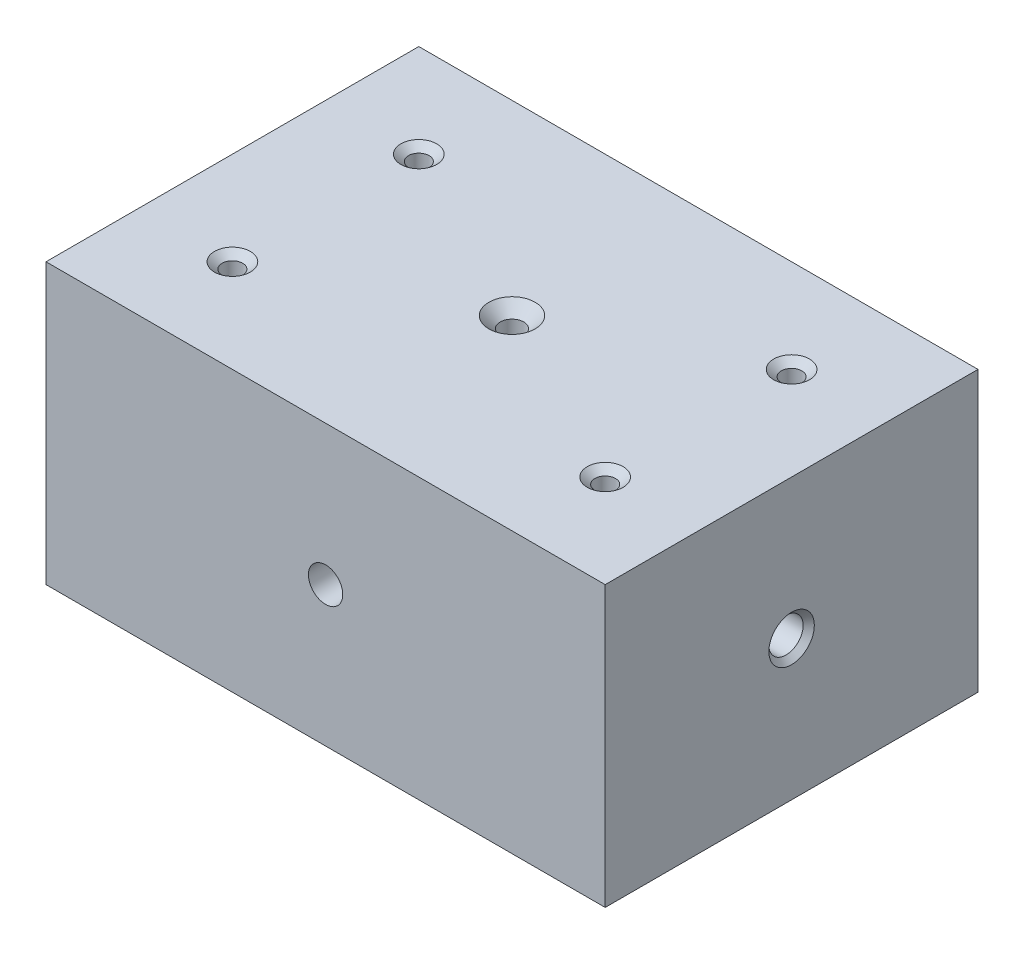
ISO-10303-21;
HEADER;
FILE_DESCRIPTION(('STEP AP214'),'2;1');
FILE_NAME('part.step','',(''),(''),'','','');
FILE_SCHEMA(('AUTOMOTIVE_DESIGN { 1 0 10303 214 1 1 1 1 }'));
ENDSEC;
DATA;
#1=APPLICATION_CONTEXT('core data for automotive mechanical design processes');
#2=APPLICATION_PROTOCOL_DEFINITION('international standard','automotive_design',2000,#1);
#3=PRODUCT_CONTEXT('',#1,'mechanical');
#4=PRODUCT('Part','Part','',(#3));
#5=PRODUCT_RELATED_PRODUCT_CATEGORY('part','',(#4));
#6=PRODUCT_DEFINITION_FORMATION('','',#4);
#7=PRODUCT_DEFINITION_CONTEXT('part definition',#1,'design');
#8=PRODUCT_DEFINITION('design','',#6,#7);
#9=PRODUCT_DEFINITION_SHAPE('','',#8);
#10=(LENGTH_UNIT() NAMED_UNIT(*) SI_UNIT(.MILLI.,.METRE.));
#11=(NAMED_UNIT(*) PLANE_ANGLE_UNIT() SI_UNIT($,.RADIAN.));
#12=(NAMED_UNIT(*) SI_UNIT($,.STERADIAN.) SOLID_ANGLE_UNIT());
#13=UNCERTAINTY_MEASURE_WITH_UNIT(LENGTH_MEASURE(1.E-05),#10,'distance_accuracy_value','');
#14=(GEOMETRIC_REPRESENTATION_CONTEXT(3) GLOBAL_UNCERTAINTY_ASSIGNED_CONTEXT((#13)) GLOBAL_UNIT_ASSIGNED_CONTEXT((#10,
#11,#12)) REPRESENTATION_CONTEXT('',''));
#15=CARTESIAN_POINT('',(0.,0.,0.));
#16=DIRECTION('',(0.,0.,1.));
#17=DIRECTION('',(1.,0.,0.));
#18=AXIS2_PLACEMENT_3D('',#15,#16,#17);
#19=CARTESIAN_POINT('',(0.,76.2,0.));
#20=DIRECTION('',(0.,1.,0.));
#21=DIRECTION('',(0.,0.,1.));
#22=AXIS2_PLACEMENT_3D('',#19,#20,#21);
#23=CYLINDRICAL_SURFACE('',#22,3.2);
#24=CARTESIAN_POINT('',(0.,33.4264,3.2));
#25=CARTESIAN_POINT('',(0.159849029235116,33.4264038122974,3.19999568075959));
#26=CARTESIAN_POINT('',(0.319723169020184,33.4346737018388,3.18795249811908));
#27=CARTESIAN_POINT('',(0.634349905593429,33.4669451235395,3.14053425751426));
#28=CARTESIAN_POINT('',(0.789099466263793,33.4909558123468,3.10514561908918));
#29=CARTESIAN_POINT('',(1.08843625063093,33.5523522216538,3.01325776614649));
#30=CARTESIAN_POINT('',(1.2330688820062,33.5896728846319,2.95686117728689));
#31=CARTESIAN_POINT('',(1.510168469912,33.6747355468776,2.82540903762856));
#32=CARTESIAN_POINT('',(1.6426339019402,33.7224788495375,2.75035115299816));
#33=CARTESIAN_POINT('',(1.90464103865584,33.8295661103611,2.57665682108809));
#34=CARTESIAN_POINT('',(2.03293050924296,33.8895573506275,2.47653908445413));
#35=CARTESIAN_POINT('',(2.27206060380369,34.0136240134829,2.25918172879749));
#36=CARTESIAN_POINT('',(2.3828750641159,34.0777053620444,2.14191693360954));
#37=CARTESIAN_POINT('',(2.6029398364526,34.2158297647036,1.87086176091448));
#38=CARTESIAN_POINT('',(2.7088138973547,34.2897419697147,1.71424373278135));
#39=CARTESIAN_POINT('',(2.89270905706993,34.4274050699534,1.3813888369528));
#40=CARTESIAN_POINT('',(2.97077781360163,34.4911732469804,1.20518622381675));
#41=CARTESIAN_POINT('',(3.0763384769863,34.5811971099609,0.891440577634687));
#42=CARTESIAN_POINT('',(3.11198169649243,34.6129663981498,0.758240071361173));
#43=CARTESIAN_POINT('',(3.16593337116262,34.6618671683608,0.485859057427902));
#44=CARTESIAN_POINT('',(3.18427369945283,34.6790255589657,0.3466900407337));
#45=CARTESIAN_POINT('',(3.20244888925678,34.6960258937052,0.0653474123882146));
#46=CARTESIAN_POINT('',(3.20219224142086,34.6957822082694,-0.0768376147081175));
#47=CARTESIAN_POINT('',(3.18296081556693,34.6778008512921,-0.358846306954445));
#48=CARTESIAN_POINT('',(3.16397257755738,34.660050600029,-0.498668200535904));
#49=CARTESIAN_POINT('',(3.11016559476871,34.6113602735324,-0.764361984533678));
#50=CARTESIAN_POINT('',(3.07628378450488,34.5812067843965,-0.890577426607787));
#51=CARTESIAN_POINT('',(2.99451888194887,34.5113673226816,-1.13559014304029));
#52=CARTESIAN_POINT('',(2.94662486666779,34.4716739177405,-1.25438154209824));
#53=CARTESIAN_POINT('',(2.81103844580922,34.3648616569788,-1.5408522263267));
#54=CARTESIAN_POINT('',(2.7154089196482,34.2939360406195,-1.70337689081111));
#55=CARTESIAN_POINT('',(2.49833263794546,34.1480328290222,-2.00834766817381));
#56=CARTESIAN_POINT('',(2.37683683771935,34.0730477409718,-2.15075477089889));
#57=CARTESIAN_POINT('',(2.10847863683613,33.9262147765162,-2.4145434271581));
#58=CARTESIAN_POINT('',(1.96138993545795,33.8544027382102,-2.53571620428751));
#59=CARTESIAN_POINT('',(1.64468227549187,33.7220022137016,-2.75165022733859));
#60=CARTESIAN_POINT('',(1.47511104228702,33.6613905864835,-2.84646613807468));
#61=CARTESIAN_POINT('',(1.15677685422291,33.5694957537419,-2.98749007530789));
#62=CARTESIAN_POINT('',(1.01173806720014,33.5346894270401,-3.03981451947163));
#63=CARTESIAN_POINT('',(0.713181223218967,33.4786462508486,-3.1233545930654));
#64=CARTESIAN_POINT('',(0.55966898051009,33.4574002193848,-3.15458450690312));
#65=CARTESIAN_POINT('',(0.247795199406724,33.4303417484351,-3.19427380284223));
#66=CARTESIAN_POINT('',(0.0894185328348846,33.4245837361474,-3.20265288515664));
#67=CARTESIAN_POINT('',(-0.226596088074102,33.4292229126399,-3.19587681456339));
#68=CARTESIAN_POINT('',(-0.384234020365229,33.4396205805128,-3.18072096373336));
#69=CARTESIAN_POINT('',(-0.685135428250788,33.4745478556312,-3.12931249782607));
#70=CARTESIAN_POINT('',(-0.828709884518078,33.4982551715898,-3.09428629045339));
#71=CARTESIAN_POINT('',(-1.10749183151761,33.5572781538129,-3.00580575162621));
#72=CARTESIAN_POINT('',(-1.2426977755948,33.592595958342,-2.95234802561238));
#73=CARTESIAN_POINT('',(-1.51263047870177,33.6755269308123,-2.82418167670306));
#74=CARTESIAN_POINT('',(-1.64648684217909,33.7238875253025,-2.74813451129438));
#75=CARTESIAN_POINT('',(-1.90009093663857,33.8278794790124,-2.57932136431337));
#76=CARTESIAN_POINT('',(-2.01982823488951,33.8835161513744,-2.48654314643667));
#77=CARTESIAN_POINT('',(-2.26304852251027,34.008201287466,-2.26925487720594));
#78=CARTESIAN_POINT('',(-2.38376166679126,34.0779297860484,-2.14203217681555));
#79=CARTESIAN_POINT('',(-2.60321039391167,34.2163597778312,-1.86921571923878));
#80=CARTESIAN_POINT('',(-2.70193451342168,34.2850607180171,-1.7236124415593));
#81=CARTESIAN_POINT('',(-2.86412014380463,34.4056530811915,-1.43543313861792));
#82=CARTESIAN_POINT('',(-2.93050095138284,34.4585682897925,-1.29493738864562));
#83=CARTESIAN_POINT('',(-3.04301321836899,34.5520453537885,-1.00226282898058));
#84=CARTESIAN_POINT('',(-3.08918451954554,34.5926314664162,-0.850107707627568));
#85=CARTESIAN_POINT('',(-3.15269884523307,34.6497039705846,-0.563987658503894));
#86=CARTESIAN_POINT('',(-3.1736467381119,34.6691444718721,-0.431428170158612));
#87=CARTESIAN_POINT('',(-3.19864984478053,34.6924358240507,-0.163413270547835));
#88=CARTESIAN_POINT('',(-3.20272162396231,34.6963019624462,-0.0279608303436167));
#89=CARTESIAN_POINT('',(-3.19370470985988,34.6878431388635,0.241806926955834));
#90=CARTESIAN_POINT('',(-3.18061916147075,34.6755211441288,0.376122447904089));
#91=CARTESIAN_POINT('',(-3.1381871772204,34.6366029704594,0.640089438716311));
#92=CARTESIAN_POINT('',(-3.1088176133492,34.6099864909147,0.769733994908119));
#93=CARTESIAN_POINT('',(-3.02380816300769,34.5358469660746,1.06127397325458));
#94=CARTESIAN_POINT('',(-2.96282802542705,34.4843904801702,1.22059398313048));
#95=CARTESIAN_POINT('',(-2.81851341661108,34.3707991810791,1.52460025523889));
#96=CARTESIAN_POINT('',(-2.73514502202424,34.3086482150674,1.66926384766822));
#97=CARTESIAN_POINT('',(-2.54613743700645,34.1791400354551,1.94571438042799));
#98=CARTESIAN_POINT('',(-2.44006528596707,34.1117006177742,2.07716505245277));
#99=CARTESIAN_POINT('',(-2.20793649461942,33.9786614571964,2.32238940538557));
#100=CARTESIAN_POINT('',(-2.08187374122075,33.9130622842885,2.43615765790016));
#101=CARTESIAN_POINT('',(-1.86940270620986,33.8157148945135,2.59899689119889));
#102=CARTESIAN_POINT('',(-1.78923107018314,33.7815331858876,2.65486203493008));
#103=CARTESIAN_POINT('',(-1.62317438301266,33.7164189589359,2.75951595603917));
#104=CARTESIAN_POINT('',(-1.53729214523034,33.685484859746,2.80830818080264));
#105=CARTESIAN_POINT('',(-1.36035691614792,33.6277959603609,2.89814693123615));
#106=CARTESIAN_POINT('',(-1.26931039480836,33.6010360816754,2.93920288196192));
#107=CARTESIAN_POINT('',(-1.0826688056013,33.5525092717964,3.01295587213322));
#108=CARTESIAN_POINT('',(-0.987075685380479,33.5307402255084,3.04565645322584));
#109=CARTESIAN_POINT('',(-0.746858533095052,33.4841799011859,3.11515933516305));
#110=CARTESIAN_POINT('',(-0.600047115444134,33.4626653601254,3.14683634791851));
#111=CARTESIAN_POINT('',(-0.302162782869578,33.4337780548391,3.18925213736012));
#112=CARTESIAN_POINT('',(-0.151092608846565,33.4263963965377,3.20000408263538));
#113=CARTESIAN_POINT('',(0.,33.4264,3.2));
#114=B_SPLINE_CURVE_WITH_KNOTS('',3,(#24,#25,#26,#27,#28,#29,#30,#31,#32,#33,#34,#35,#36,#37,
#38,#39,#40,#41,#42,#43,#44,#45,#46,#47,#48,#49,#50,#51,#52,#53,#54,#55,#56,#57,#58,#59,#60,#61,
#62,#63,#64,#65,#66,#67,#68,#69,#70,#71,#72,#73,#74,#75,#76,#77,#78,#79,#80,#81,#82,#83,#84,#85,
#86,#87,#88,#89,#90,#91,#92,#93,#94,#95,#96,#97,#98,#99,#100,#101,#102,#103,#104,#105,#106,#107,
#108,#109,#110,#111,#112,#113),.UNSPECIFIED.,.T.,.F.,(4,2,2,2,2,2,2,2,2,2,2,2,2,2,2,2,2,2,2,2,2,
2,2,2,2,2,2,2,2,2,2,2,2,2,2,2,2,2,2,2,2,2,2,2,4),(0.,0.478950741187537,0.958180342389751,
1.43509892834526,1.91207718904575,2.4304650420972,2.9496218061111,3.5558073246674,
4.16094879627608,4.58380876719109,5.00588827101029,5.43004482386279,5.85450638580794,
6.25541381256308,6.65663459676063,7.25789452519902,7.86030481241409,8.46834097094219,
9.07510647451775,9.54732098355126,10.0192154055782,10.4927659813069,10.9663306003236,
11.4134283714304,11.8606085292006,12.3428842259379,12.8255140775257,13.3894852875744,
13.9537498227823,14.4444477048707,14.9341738014105,15.3391987169542,15.7438259705763,
16.1483790674053,16.5535082239253,17.0851837975532,17.6176695722777,18.161395432807,
18.705287885509,19.0154722706393,19.3255049578929,19.6351574569713,19.9446784829879,
20.3976778048554,20.8503919523313),.UNSPECIFIED.);
#115=CARTESIAN_POINT('',(0.,33.4264,3.2));
#116=VERTEX_POINT('',#115);
#117=EDGE_CURVE('E43',#116,#116,#114,.T.);
#118=ORIENTED_EDGE('',*,*,#117,.T.);
#119=EDGE_LOOP('',(#118));
#120=FACE_BOUND('',#119,.T.);
#121=CARTESIAN_POINT('',(0.,0.,0.));
#122=DIRECTION('',(0.,1.,0.));
#123=DIRECTION('',(0.,0.,1.));
#124=AXIS2_PLACEMENT_3D('',#121,#122,#123);
#125=CIRCLE('',#124,3.2);
#126=CARTESIAN_POINT('',(0.,0.,3.2));
#127=VERTEX_POINT('',#126);
#128=EDGE_CURVE('E121',#127,#127,#125,.T.);
#129=ORIENTED_EDGE('',*,*,#128,.F.);
#130=EDGE_LOOP('',(#129));
#131=FACE_BOUND('',#130,.T.);
#132=ADVANCED_FACE('F39',(#120,#131),#23,.F.);
#133=CARTESIAN_POINT('',(76.2,76.2,-50.8));
#134=DIRECTION('',(-1.,0.,0.));
#135=DIRECTION('',(0.,0.,1.));
#136=AXIS2_PLACEMENT_3D('',#133,#134,#135);
#137=PLANE('',#136);
#138=CARTESIAN_POINT('',(76.2,38.1,0.));
#139=DIRECTION('',(1.,0.,0.));
#140=DIRECTION('',(0.,0.,-1.));
#141=AXIS2_PLACEMENT_3D('',#138,#139,#140);
#142=CIRCLE('',#141,6.19125);
#143=CARTESIAN_POINT('',(76.2,38.1,-6.19125));
#144=VERTEX_POINT('',#143);
#145=EDGE_CURVE('E115',#144,#144,#142,.T.);
#146=ORIENTED_EDGE('',*,*,#145,.F.);
#147=EDGE_LOOP('',(#146));
#148=FACE_BOUND('',#147,.T.);
#149=DIRECTION('',(0.,0.,-1.));
#150=VECTOR('',#149,1.);
#151=CARTESIAN_POINT('',(76.2,0.,-50.8));
#152=LINE('',#151,#150);
#153=CARTESIAN_POINT('',(76.2,0.,50.8));
#154=VERTEX_POINT('',#153);
#155=CARTESIAN_POINT('',(76.2,0.,-50.8));
#156=VERTEX_POINT('',#155);
#157=EDGE_CURVE('E160',#154,#156,#152,.T.);
#158=ORIENTED_EDGE('',*,*,#157,.T.);
#159=DIRECTION('',(0.,-1.,0.));
#160=VECTOR('',#159,1.);
#161=CARTESIAN_POINT('',(76.2,76.2,-50.8));
#162=LINE('',#161,#160);
#163=CARTESIAN_POINT('',(76.2,76.2,-50.8));
#164=VERTEX_POINT('',#163);
#165=EDGE_CURVE('E11',#164,#156,#162,.T.);
#166=ORIENTED_EDGE('',*,*,#165,.F.);
#167=DIRECTION('',(0.,0.,-1.));
#168=VECTOR('',#167,1.);
#169=CARTESIAN_POINT('',(76.2,76.2,-50.8));
#170=LINE('',#169,#168);
#171=CARTESIAN_POINT('',(76.2,76.2,50.8));
#172=VERTEX_POINT('',#171);
#173=EDGE_CURVE('E161',#172,#164,#170,.T.);
#174=ORIENTED_EDGE('',*,*,#173,.F.);
#175=DIRECTION('',(0.,-1.,0.));
#176=VECTOR('',#175,1.);
#177=CARTESIAN_POINT('',(76.2,76.2,50.8));
#178=LINE('',#177,#176);
#179=EDGE_CURVE('E167',#172,#154,#178,.T.);
#180=ORIENTED_EDGE('',*,*,#179,.T.);
#181=EDGE_LOOP('',(#158,#166,#174,#180));
#182=FACE_BOUND('',#181,.T.);
#183=ADVANCED_FACE('F41',(#148,#182),#137,.F.);
#184=CARTESIAN_POINT('',(-76.2,76.2,-50.8));
#185=DIRECTION('',(0.,0.,1.));
#186=DIRECTION('',(1.,0.,0.));
#187=AXIS2_PLACEMENT_3D('',#184,#185,#186);
#188=PLANE('',#187);
#189=CARTESIAN_POINT('',(0.,38.1,-50.8));
#190=DIRECTION('',(0.,0.,1.));
#191=DIRECTION('',(1.,0.,0.));
#192=AXIS2_PLACEMENT_3D('',#189,#190,#191);
#193=CIRCLE('',#192,4.67359999999997);
#194=CARTESIAN_POINT('',(4.67359999999997,38.1,-50.8));
#195=VERTEX_POINT('',#194);
#196=EDGE_CURVE('E182',#195,#195,#193,.T.);
#197=ORIENTED_EDGE('',*,*,#196,.T.);
#198=EDGE_LOOP('',(#197));
#199=FACE_BOUND('',#198,.T.);
#200=DIRECTION('',(-1.,0.,0.));
#201=VECTOR('',#200,1.);
#202=CARTESIAN_POINT('',(-76.2,0.,-50.8));
#203=LINE('',#202,#201);
#204=CARTESIAN_POINT('',(-76.2,0.,-50.8));
#205=VERTEX_POINT('',#204);
#206=EDGE_CURVE('E170',#156,#205,#203,.T.);
#207=ORIENTED_EDGE('',*,*,#206,.T.);
#208=DIRECTION('',(0.,-1.,0.));
#209=VECTOR('',#208,1.);
#210=CARTESIAN_POINT('',(-76.2,76.2,-50.8));
#211=LINE('',#210,#209);
#212=CARTESIAN_POINT('',(-76.2,76.2,-50.8));
#213=VERTEX_POINT('',#212);
#214=EDGE_CURVE('E54',#213,#205,#211,.T.);
#215=ORIENTED_EDGE('',*,*,#214,.F.);
#216=DIRECTION('',(-1.,0.,0.));
#217=VECTOR('',#216,1.);
#218=CARTESIAN_POINT('',(-76.2,76.2,-50.8));
#219=LINE('',#218,#217);
#220=EDGE_CURVE('E94',#164,#213,#219,.T.);
#221=ORIENTED_EDGE('',*,*,#220,.F.);
#222=ORIENTED_EDGE('',*,*,#165,.T.);
#223=EDGE_LOOP('',(#207,#215,#221,#222));
#224=FACE_BOUND('',#223,.T.);
#225=ADVANCED_FACE('F212',(#199,#224),#188,.F.);
#226=CARTESIAN_POINT('',(-76.2,76.2,-50.8));
#227=DIRECTION('',(1.,0.,0.));
#228=DIRECTION('',(0.,0.,-1.));
#229=AXIS2_PLACEMENT_3D('',#226,#227,#228);
#230=PLANE('',#229);
#231=DIRECTION('',(0.,0.,1.));
#232=VECTOR('',#231,1.);
#233=CARTESIAN_POINT('',(-76.2,0.,-50.8));
#234=LINE('',#233,#232);
#235=CARTESIAN_POINT('',(-76.2,0.,50.8));
#236=VERTEX_POINT('',#235);
#237=EDGE_CURVE('E81',#205,#236,#234,.T.);
#238=ORIENTED_EDGE('',*,*,#237,.T.);
#239=DIRECTION('',(0.,-1.,0.));
#240=VECTOR('',#239,1.);
#241=CARTESIAN_POINT('',(-76.2,76.2,50.8));
#242=LINE('',#241,#240);
#243=CARTESIAN_POINT('',(-76.2,76.2,50.8));
#244=VERTEX_POINT('',#243);
#245=EDGE_CURVE('E175',#244,#236,#242,.T.);
#246=ORIENTED_EDGE('',*,*,#245,.F.);
#247=DIRECTION('',(0.,0.,1.));
#248=VECTOR('',#247,1.);
#249=CARTESIAN_POINT('',(-76.2,76.2,-50.8));
#250=LINE('',#249,#248);
#251=EDGE_CURVE('E164',#213,#244,#250,.T.);
#252=ORIENTED_EDGE('',*,*,#251,.F.);
#253=ORIENTED_EDGE('',*,*,#214,.T.);
#254=EDGE_LOOP('',(#238,#246,#252,#253));
#255=FACE_BOUND('',#254,.T.);
#256=ADVANCED_FACE('F239',(#255),#230,.F.);
#257=CARTESIAN_POINT('',(-76.2,76.2,50.8));
#258=DIRECTION('',(0.,0.,-1.));
#259=DIRECTION('',(-1.,0.,0.));
#260=AXIS2_PLACEMENT_3D('',#257,#258,#259);
#261=PLANE('',#260);
#262=CARTESIAN_POINT('',(0.,38.1,50.8));
#263=DIRECTION('',(0.,0.,1.));
#264=DIRECTION('',(1.,0.,0.));
#265=AXIS2_PLACEMENT_3D('',#262,#263,#264);
#266=CIRCLE('',#265,4.67359999999999);
#267=CARTESIAN_POINT('',(4.67359999999999,38.1,50.8));
#268=VERTEX_POINT('',#267);
#269=EDGE_CURVE('E445',#268,#268,#266,.T.);
#270=ORIENTED_EDGE('',*,*,#269,.F.);
#271=EDGE_LOOP('',(#270));
#272=FACE_BOUND('',#271,.T.);
#273=DIRECTION('',(1.,0.,0.));
#274=VECTOR('',#273,1.);
#275=CARTESIAN_POINT('',(-76.2,0.,50.8));
#276=LINE('',#275,#274);
#277=EDGE_CURVE('E87',#236,#154,#276,.T.);
#278=ORIENTED_EDGE('',*,*,#277,.T.);
#279=ORIENTED_EDGE('',*,*,#179,.F.);
#280=DIRECTION('',(1.,0.,0.));
#281=VECTOR('',#280,1.);
#282=CARTESIAN_POINT('',(-76.2,76.2,50.8));
#283=LINE('',#282,#281);
#284=EDGE_CURVE('E63',#244,#172,#283,.T.);
#285=ORIENTED_EDGE('',*,*,#284,.F.);
#286=ORIENTED_EDGE('',*,*,#245,.T.);
#287=EDGE_LOOP('',(#278,#279,#285,#286));
#288=FACE_BOUND('',#287,.T.);
#289=ADVANCED_FACE('F237',(#272,#288),#261,.F.);
#290=CARTESIAN_POINT('',(0.,76.2,0.));
#291=DIRECTION('',(0.,1.,0.));
#292=DIRECTION('',(0.,0.,1.));
#293=AXIS2_PLACEMENT_3D('',#290,#291,#292);
#294=PLANE('',#293);
#295=CARTESIAN_POINT('',(0.,76.2,0.));
#296=DIRECTION('',(0.,1.,0.));
#297=DIRECTION('',(0.,0.,1.));
#298=AXIS2_PLACEMENT_3D('',#295,#296,#297);
#299=CIRCLE('',#298,6.3);
#300=CARTESIAN_POINT('',(0.,76.2,6.3));
#301=VERTEX_POINT('',#300);
#302=EDGE_CURVE('E108',#301,#301,#299,.T.);
#303=ORIENTED_EDGE('',*,*,#302,.F.);
#304=EDGE_LOOP('',(#303));
#305=FACE_BOUND('',#304,.T.);
#306=CARTESIAN_POINT('',(-50.8,76.2,-25.4));
#307=DIRECTION('',(0.,1.,0.));
#308=DIRECTION('',(0.,0.,1.));
#309=AXIS2_PLACEMENT_3D('',#306,#307,#308);
#310=CIRCLE('',#309,4.8895);
#311=CARTESIAN_POINT('',(-50.8,76.2,-20.5105));
#312=VERTEX_POINT('',#311);
#313=EDGE_CURVE('E124',#312,#312,#310,.T.);
#314=ORIENTED_EDGE('',*,*,#313,.F.);
#315=EDGE_LOOP('',(#314));
#316=FACE_BOUND('',#315,.T.);
#317=CARTESIAN_POINT('',(-50.8,76.2,25.4));
#318=DIRECTION('',(0.,1.,0.));
#319=DIRECTION('',(0.,0.,1.));
#320=AXIS2_PLACEMENT_3D('',#317,#318,#319);
#321=CIRCLE('',#320,4.8895);
#322=CARTESIAN_POINT('',(-50.8,76.2,30.2895));
#323=VERTEX_POINT('',#322);
#324=EDGE_CURVE('E133',#323,#323,#321,.T.);
#325=ORIENTED_EDGE('',*,*,#324,.F.);
#326=EDGE_LOOP('',(#325));
#327=FACE_BOUND('',#326,.T.);
#328=CARTESIAN_POINT('',(50.8,76.2,25.4000000000001));
#329=DIRECTION('',(0.,1.,0.));
#330=DIRECTION('',(0.,0.,1.));
#331=AXIS2_PLACEMENT_3D('',#328,#329,#330);
#332=CIRCLE('',#331,4.8895);
#333=CARTESIAN_POINT('',(50.8,76.2,30.2895000000001));
#334=VERTEX_POINT('',#333);
#335=EDGE_CURVE('E142',#334,#334,#332,.T.);
#336=ORIENTED_EDGE('',*,*,#335,.F.);
#337=EDGE_LOOP('',(#336));
#338=FACE_BOUND('',#337,.T.);
#339=CARTESIAN_POINT('',(50.8,76.2,-25.3999999999999));
#340=DIRECTION('',(0.,1.,0.));
#341=DIRECTION('',(0.,0.,1.));
#342=AXIS2_PLACEMENT_3D('',#339,#340,#341);
#343=CIRCLE('',#342,4.8895);
#344=CARTESIAN_POINT('',(50.8,76.2,-20.5104999999999));
#345=VERTEX_POINT('',#344);
#346=EDGE_CURVE('E151',#345,#345,#343,.T.);
#347=ORIENTED_EDGE('',*,*,#346,.F.);
#348=EDGE_LOOP('',(#347));
#349=FACE_BOUND('',#348,.T.);
#350=ORIENTED_EDGE('',*,*,#173,.T.);
#351=ORIENTED_EDGE('',*,*,#220,.T.);
#352=ORIENTED_EDGE('',*,*,#251,.T.);
#353=ORIENTED_EDGE('',*,*,#284,.T.);
#354=EDGE_LOOP('',(#350,#351,#352,#353));
#355=FACE_BOUND('',#354,.T.);
#356=ADVANCED_FACE('F223',(#305,#316,#327,#338,#349,#355),#294,.T.);
#357=CARTESIAN_POINT('',(0.,0.,0.));
#358=DIRECTION('',(0.,1.,0.));
#359=DIRECTION('',(0.,0.,1.));
#360=AXIS2_PLACEMENT_3D('',#357,#358,#359);
#361=PLANE('',#360);
#362=ORIENTED_EDGE('',*,*,#128,.T.);
#363=EDGE_LOOP('',(#362));
#364=FACE_BOUND('',#363,.T.);
#365=CARTESIAN_POINT('',(-50.8,0.,-25.4));
#366=DIRECTION('',(0.,1.,0.));
#367=DIRECTION('',(0.,0.,1.));
#368=AXIS2_PLACEMENT_3D('',#365,#366,#367);
#369=CIRCLE('',#368,2.80669999999999);
#370=CARTESIAN_POINT('',(-50.8,0.,-22.5933));
#371=VERTEX_POINT('',#370);
#372=EDGE_CURVE('E130',#371,#371,#369,.T.);
#373=ORIENTED_EDGE('',*,*,#372,.T.);
#374=EDGE_LOOP('',(#373));
#375=FACE_BOUND('',#374,.T.);
#376=CARTESIAN_POINT('',(-50.8,0.,25.4));
#377=DIRECTION('',(0.,1.,0.));
#378=DIRECTION('',(0.,0.,1.));
#379=AXIS2_PLACEMENT_3D('',#376,#377,#378);
#380=CIRCLE('',#379,2.80669999999999);
#381=CARTESIAN_POINT('',(-50.8,0.,28.2067));
#382=VERTEX_POINT('',#381);
#383=EDGE_CURVE('E139',#382,#382,#380,.T.);
#384=ORIENTED_EDGE('',*,*,#383,.T.);
#385=EDGE_LOOP('',(#384));
#386=FACE_BOUND('',#385,.T.);
#387=CARTESIAN_POINT('',(50.8,0.,25.4000000000001));
#388=DIRECTION('',(0.,1.,0.));
#389=DIRECTION('',(0.,0.,1.));
#390=AXIS2_PLACEMENT_3D('',#387,#388,#389);
#391=CIRCLE('',#390,2.80669999999999);
#392=CARTESIAN_POINT('',(50.8,0.,28.2067));
#393=VERTEX_POINT('',#392);
#394=EDGE_CURVE('E148',#393,#393,#391,.T.);
#395=ORIENTED_EDGE('',*,*,#394,.T.);
#396=EDGE_LOOP('',(#395));
#397=FACE_BOUND('',#396,.T.);
#398=CARTESIAN_POINT('',(50.8,0.,-25.3999999999999));
#399=DIRECTION('',(0.,1.,0.));
#400=DIRECTION('',(0.,0.,1.));
#401=AXIS2_PLACEMENT_3D('',#398,#399,#400);
#402=CIRCLE('',#401,2.80669999999999);
#403=CARTESIAN_POINT('',(50.8,0.,-22.5933));
#404=VERTEX_POINT('',#403);
#405=EDGE_CURVE('E157',#404,#404,#402,.T.);
#406=ORIENTED_EDGE('',*,*,#405,.T.);
#407=EDGE_LOOP('',(#406));
#408=FACE_BOUND('',#407,.T.);
#409=ORIENTED_EDGE('',*,*,#157,.F.);
#410=ORIENTED_EDGE('',*,*,#277,.F.);
#411=ORIENTED_EDGE('',*,*,#237,.F.);
#412=ORIENTED_EDGE('',*,*,#206,.F.);
#413=EDGE_LOOP('',(#409,#410,#411,#412));
#414=FACE_BOUND('',#413,.T.);
#415=ADVANCED_FACE('F219',(#364,#375,#386,#397,#408,#414),#361,.F.);
#416=CARTESIAN_POINT('',(50.8,76.2,-25.3999999999999));
#417=DIRECTION('',(0.,1.,0.));
#418=DIRECTION('',(0.,0.,1.));
#419=AXIS2_PLACEMENT_3D('',#416,#417,#418);
#420=CYLINDRICAL_SURFACE('',#419,2.80669999999999);
#421=ORIENTED_EDGE('',*,*,#405,.F.);
#422=EDGE_LOOP('',(#421));
#423=FACE_BOUND('',#422,.T.);
#424=CARTESIAN_POINT('',(50.8,74.452323288184,-25.3999999999999));
#425=DIRECTION('',(0.,1.,0.));
#426=DIRECTION('',(0.,0.,1.));
#427=AXIS2_PLACEMENT_3D('',#424,#425,#426);
#428=CIRCLE('',#427,2.80669999999999);
#429=CARTESIAN_POINT('',(50.8,74.452323288184,-22.5933));
#430=VERTEX_POINT('',#429);
#431=EDGE_CURVE('E154',#430,#430,#428,.T.);
#432=ORIENTED_EDGE('',*,*,#431,.T.);
#433=EDGE_LOOP('',(#432));
#434=FACE_BOUND('',#433,.T.);
#435=ADVANCED_FACE('F222',(#423,#434),#420,.F.);
#436=CARTESIAN_POINT('',(50.8,76.2,-25.3999999999999));
#437=DIRECTION('',(0.,1.,0.));
#438=DIRECTION('',(0.,0.,1.));
#439=AXIS2_PLACEMENT_3D('',#436,#437,#438);
#440=CONICAL_SURFACE('',#439,4.8895,0.872664625997167);
#441=ORIENTED_EDGE('',*,*,#431,.F.);
#442=EDGE_LOOP('',(#441));
#443=FACE_BOUND('',#442,.T.);
#444=ORIENTED_EDGE('',*,*,#346,.T.);
#445=EDGE_LOOP('',(#444));
#446=FACE_BOUND('',#445,.T.);
#447=ADVANCED_FACE('F256',(#443,#446),#440,.F.);
#448=CARTESIAN_POINT('',(50.8,76.2,25.4000000000001));
#449=DIRECTION('',(0.,1.,0.));
#450=DIRECTION('',(0.,0.,1.));
#451=AXIS2_PLACEMENT_3D('',#448,#449,#450);
#452=CYLINDRICAL_SURFACE('',#451,2.80669999999999);
#453=ORIENTED_EDGE('',*,*,#394,.F.);
#454=EDGE_LOOP('',(#453));
#455=FACE_BOUND('',#454,.T.);
#456=CARTESIAN_POINT('',(50.8,74.452323288184,25.4000000000001));
#457=DIRECTION('',(0.,1.,0.));
#458=DIRECTION('',(0.,0.,1.));
#459=AXIS2_PLACEMENT_3D('',#456,#457,#458);
#460=CIRCLE('',#459,2.80669999999999);
#461=CARTESIAN_POINT('',(50.8,74.452323288184,28.2067));
#462=VERTEX_POINT('',#461);
#463=EDGE_CURVE('E145',#462,#462,#460,.T.);
#464=ORIENTED_EDGE('',*,*,#463,.T.);
#465=EDGE_LOOP('',(#464));
#466=FACE_BOUND('',#465,.T.);
#467=ADVANCED_FACE('F260',(#455,#466),#452,.F.);
#468=CARTESIAN_POINT('',(50.8,76.2,25.4000000000001));
#469=DIRECTION('',(0.,1.,0.));
#470=DIRECTION('',(0.,0.,1.));
#471=AXIS2_PLACEMENT_3D('',#468,#469,#470);
#472=CONICAL_SURFACE('',#471,4.8895,0.872664625997167);
#473=ORIENTED_EDGE('',*,*,#463,.F.);
#474=EDGE_LOOP('',(#473));
#475=FACE_BOUND('',#474,.T.);
#476=ORIENTED_EDGE('',*,*,#335,.T.);
#477=EDGE_LOOP('',(#476));
#478=FACE_BOUND('',#477,.T.);
#479=ADVANCED_FACE('F264',(#475,#478),#472,.F.);
#480=CARTESIAN_POINT('',(-50.8,76.2,25.4));
#481=DIRECTION('',(0.,1.,0.));
#482=DIRECTION('',(0.,0.,1.));
#483=AXIS2_PLACEMENT_3D('',#480,#481,#482);
#484=CYLINDRICAL_SURFACE('',#483,2.80669999999999);
#485=ORIENTED_EDGE('',*,*,#383,.F.);
#486=EDGE_LOOP('',(#485));
#487=FACE_BOUND('',#486,.T.);
#488=CARTESIAN_POINT('',(-50.8,74.452323288184,25.4));
#489=DIRECTION('',(0.,1.,0.));
#490=DIRECTION('',(0.,0.,1.));
#491=AXIS2_PLACEMENT_3D('',#488,#489,#490);
#492=CIRCLE('',#491,2.80669999999999);
#493=CARTESIAN_POINT('',(-50.8,74.452323288184,28.2067));
#494=VERTEX_POINT('',#493);
#495=EDGE_CURVE('E136',#494,#494,#492,.T.);
#496=ORIENTED_EDGE('',*,*,#495,.T.);
#497=EDGE_LOOP('',(#496));
#498=FACE_BOUND('',#497,.T.);
#499=ADVANCED_FACE('F268',(#487,#498),#484,.F.);
#500=CARTESIAN_POINT('',(-50.8,76.2,25.4));
#501=DIRECTION('',(0.,1.,0.));
#502=DIRECTION('',(0.,0.,1.));
#503=AXIS2_PLACEMENT_3D('',#500,#501,#502);
#504=CONICAL_SURFACE('',#503,4.8895,0.872664625997167);
#505=ORIENTED_EDGE('',*,*,#495,.F.);
#506=EDGE_LOOP('',(#505));
#507=FACE_BOUND('',#506,.T.);
#508=ORIENTED_EDGE('',*,*,#324,.T.);
#509=EDGE_LOOP('',(#508));
#510=FACE_BOUND('',#509,.T.);
#511=ADVANCED_FACE('F272',(#507,#510),#504,.F.);
#512=CARTESIAN_POINT('',(-50.8,76.2,-25.4));
#513=DIRECTION('',(0.,1.,0.));
#514=DIRECTION('',(0.,0.,1.));
#515=AXIS2_PLACEMENT_3D('',#512,#513,#514);
#516=CYLINDRICAL_SURFACE('',#515,2.80669999999999);
#517=ORIENTED_EDGE('',*,*,#372,.F.);
#518=EDGE_LOOP('',(#517));
#519=FACE_BOUND('',#518,.T.);
#520=CARTESIAN_POINT('',(-50.8,74.452323288184,-25.4));
#521=DIRECTION('',(0.,1.,0.));
#522=DIRECTION('',(0.,0.,1.));
#523=AXIS2_PLACEMENT_3D('',#520,#521,#522);
#524=CIRCLE('',#523,2.80669999999999);
#525=CARTESIAN_POINT('',(-50.8,74.452323288184,-22.5933));
#526=VERTEX_POINT('',#525);
#527=EDGE_CURVE('E127',#526,#526,#524,.T.);
#528=ORIENTED_EDGE('',*,*,#527,.T.);
#529=EDGE_LOOP('',(#528));
#530=FACE_BOUND('',#529,.T.);
#531=ADVANCED_FACE('F276',(#519,#530),#516,.F.);
#532=CARTESIAN_POINT('',(-50.8,76.2,-25.4));
#533=DIRECTION('',(0.,1.,0.));
#534=DIRECTION('',(0.,0.,1.));
#535=AXIS2_PLACEMENT_3D('',#532,#533,#534);
#536=CONICAL_SURFACE('',#535,4.8895,0.872664625997167);
#537=ORIENTED_EDGE('',*,*,#527,.F.);
#538=EDGE_LOOP('',(#537));
#539=FACE_BOUND('',#538,.T.);
#540=ORIENTED_EDGE('',*,*,#313,.T.);
#541=EDGE_LOOP('',(#540));
#542=FACE_BOUND('',#541,.T.);
#543=ADVANCED_FACE('F203',(#539,#542),#536,.F.);
#544=CARTESIAN_POINT('',(0.,42.7736,3.2));
#545=CARTESIAN_POINT('',(-0.159849029235116,42.7735961877026,3.19999568075959));
#546=CARTESIAN_POINT('',(-0.319723169020184,42.7653262981612,3.18795249811908));
#547=CARTESIAN_POINT('',(-0.634349905593429,42.7330548764605,3.14053425751426));
#548=CARTESIAN_POINT('',(-0.789099466263793,42.7090441876532,3.10514561908918));
#549=CARTESIAN_POINT('',(-1.08843625063093,42.6476477783462,3.01325776614649));
#550=CARTESIAN_POINT('',(-1.2330688820062,42.6103271153682,2.95686117728689));
#551=CARTESIAN_POINT('',(-1.510168469912,42.5252644531224,2.82540903762856));
#552=CARTESIAN_POINT('',(-1.6426339019402,42.4775211504625,2.75035115299816));
#553=CARTESIAN_POINT('',(-1.90464103865584,42.3704338896389,2.57665682108809));
#554=CARTESIAN_POINT('',(-2.03293050924296,42.3104426493725,2.47653908445413));
#555=CARTESIAN_POINT('',(-2.27206060380369,42.1863759865171,2.25918172879749));
#556=CARTESIAN_POINT('',(-2.3828750641159,42.1222946379556,2.14191693360954));
#557=CARTESIAN_POINT('',(-2.6029398364526,41.9841702352964,1.87086176091448));
#558=CARTESIAN_POINT('',(-2.7088138973547,41.9102580302853,1.71424373278134));
#559=CARTESIAN_POINT('',(-2.89270905706993,41.7725949300466,1.38138883695279));
#560=CARTESIAN_POINT('',(-2.97077781360163,41.7088267530196,1.20518622381675));
#561=CARTESIAN_POINT('',(-3.0763384769863,41.6188028900391,0.891440577634686));
#562=CARTESIAN_POINT('',(-3.11198169649243,41.5870336018502,0.758240071361172));
#563=CARTESIAN_POINT('',(-3.16593337116262,41.5381328316392,0.485859057427901));
#564=CARTESIAN_POINT('',(-3.18427369945283,41.5209744410343,0.3466900407337));
#565=CARTESIAN_POINT('',(-3.20244888925678,41.5039741062948,0.0653474123882146));
#566=CARTESIAN_POINT('',(-3.20219224142086,41.5042177917306,-0.0768376147081175));
#567=CARTESIAN_POINT('',(-3.18296081556693,41.5221991487079,-0.358846306954445));
#568=CARTESIAN_POINT('',(-3.16397257755738,41.539949399971,-0.498668200535904));
#569=CARTESIAN_POINT('',(-3.11016559476871,41.5886397264676,-0.764361984533678));
#570=CARTESIAN_POINT('',(-3.07628378450488,41.6187932156035,-0.890577426607787));
#571=CARTESIAN_POINT('',(-2.99451888194887,41.6886326773184,-1.13559014304029));
#572=CARTESIAN_POINT('',(-2.94662486666779,41.7283260822595,-1.25438154209824));
#573=CARTESIAN_POINT('',(-2.81103844580922,41.8351383430212,-1.5408522263267));
#574=CARTESIAN_POINT('',(-2.7154089196482,41.9060639593805,-1.70337689081111));
#575=CARTESIAN_POINT('',(-2.49833263794546,42.0519671709778,-2.00834766817381));
#576=CARTESIAN_POINT('',(-2.37683683771935,42.1269522590282,-2.15075477089889));
#577=CARTESIAN_POINT('',(-2.10847863683613,42.2737852234838,-2.41454342715809));
#578=CARTESIAN_POINT('',(-1.96138993545795,42.3455972617898,-2.5357162042875));
#579=CARTESIAN_POINT('',(-1.64468227549187,42.4779977862984,-2.75165022733858));
#580=CARTESIAN_POINT('',(-1.47511104228702,42.5386094135165,-2.84646613807468));
#581=CARTESIAN_POINT('',(-1.15677685422291,42.6305042462581,-2.98749007530789));
#582=CARTESIAN_POINT('',(-1.01173806720014,42.6653105729599,-3.03981451947163));
#583=CARTESIAN_POINT('',(-0.713181223218967,42.7213537491514,-3.1233545930654));
#584=CARTESIAN_POINT('',(-0.55966898051009,42.7425997806152,-3.15458450690312));
#585=CARTESIAN_POINT('',(-0.247795199406724,42.7696582515649,-3.19427380284223));
#586=CARTESIAN_POINT('',(-0.0894185328348846,42.7754162638526,-3.20265288515664));
#587=CARTESIAN_POINT('',(0.226596088074102,42.7707770873601,-3.19587681456339));
#588=CARTESIAN_POINT('',(0.384234020365229,42.7603794194873,-3.18072096373336));
#589=CARTESIAN_POINT('',(0.685135428250788,42.7254521443688,-3.12931249782607));
#590=CARTESIAN_POINT('',(0.828709884518078,42.7017448284102,-3.09428629045339));
#591=CARTESIAN_POINT('',(1.10749183151761,42.6427218461871,-3.00580575162621));
#592=CARTESIAN_POINT('',(1.2426977755948,42.607404041658,-2.95234802561238));
#593=CARTESIAN_POINT('',(1.51263047870177,42.5244730691877,-2.82418167670306));
#594=CARTESIAN_POINT('',(1.64648684217909,42.4761124746975,-2.74813451129438));
#595=CARTESIAN_POINT('',(1.90009093663857,42.3721205209876,-2.57932136431337));
#596=CARTESIAN_POINT('',(2.01982823488951,42.3164838486256,-2.48654314643667));
#597=CARTESIAN_POINT('',(2.26304852251027,42.191798712534,-2.26925487720594));
#598=CARTESIAN_POINT('',(2.38376166679126,42.1220702139516,-2.14203217681555));
#599=CARTESIAN_POINT('',(2.60321039391167,41.9836402221688,-1.86921571923878));
#600=CARTESIAN_POINT('',(2.70193451342168,41.9149392819829,-1.7236124415593));
#601=CARTESIAN_POINT('',(2.86412014380463,41.7943469188086,-1.43543313861792));
#602=CARTESIAN_POINT('',(2.93050095138284,41.7414317102075,-1.29493738864562));
#603=CARTESIAN_POINT('',(3.04301321836899,41.6479546462115,-1.00226282898058));
#604=CARTESIAN_POINT('',(3.08918451954554,41.6073685335838,-0.850107707627568));
#605=CARTESIAN_POINT('',(3.15269884523307,41.5502960294154,-0.563987658503894));
#606=CARTESIAN_POINT('',(3.1736467381119,41.5308555281279,-0.431428170158612));
#607=CARTESIAN_POINT('',(3.19864984478053,41.5075641759493,-0.163413270547835));
#608=CARTESIAN_POINT('',(3.20272162396231,41.5036980375538,-0.0279608303436167));
#609=CARTESIAN_POINT('',(3.19370470985988,41.5121568611365,0.241806926955834));
#610=CARTESIAN_POINT('',(3.18061916147075,41.5244788558712,0.376122447904089));
#611=CARTESIAN_POINT('',(3.1381871772204,41.5633970295406,0.640089438716311));
#612=CARTESIAN_POINT('',(3.1088176133492,41.5900135090853,0.769733994908119));
#613=CARTESIAN_POINT('',(3.02380816300769,41.6641530339254,1.06127397325458));
#614=CARTESIAN_POINT('',(2.96282802542705,41.7156095198298,1.22059398313048));
#615=CARTESIAN_POINT('',(2.81851341661108,41.829200818921,1.52460025523889));
#616=CARTESIAN_POINT('',(2.73514502202424,41.8913517849326,1.66926384766822));
#617=CARTESIAN_POINT('',(2.54613743700645,42.0208599645449,1.94571438042799));
#618=CARTESIAN_POINT('',(2.44006528596707,42.0882993822258,2.07716505245277));
#619=CARTESIAN_POINT('',(2.20793649461942,42.2213385428036,2.32238940538557));
#620=CARTESIAN_POINT('',(2.08187374122075,42.2869377157115,2.43615765790016));
#621=CARTESIAN_POINT('',(1.86940270620986,42.3842851054865,2.59899689119889));
#622=CARTESIAN_POINT('',(1.78923107018314,42.4184668141124,2.65486203493008));
#623=CARTESIAN_POINT('',(1.62317438301266,42.4835810410641,2.75951595603917));
#624=CARTESIAN_POINT('',(1.53729214523034,42.514515140254,2.80830818080264));
#625=CARTESIAN_POINT('',(1.36035691614792,42.5722040396391,2.89814693123615));
#626=CARTESIAN_POINT('',(1.26931039480836,42.5989639183246,2.93920288196192));
#627=CARTESIAN_POINT('',(1.0826688056013,42.6474907282036,3.01295587213322));
#628=CARTESIAN_POINT('',(0.987075685380479,42.6692597744916,3.04565645322584));
#629=CARTESIAN_POINT('',(0.746858533095052,42.7158200988141,3.11515933516305));
#630=CARTESIAN_POINT('',(0.600047115444134,42.7373346398746,3.14683634791851));
#631=CARTESIAN_POINT('',(0.302162782869578,42.7662219451609,3.18925213736012));
#632=CARTESIAN_POINT('',(0.151092608846565,42.7736036034623,3.20000408263538));
#633=CARTESIAN_POINT('',(0.,42.7736,3.2));
#634=B_SPLINE_CURVE_WITH_KNOTS('',3,(#544,#545,#546,#547,#548,#549,#550,#551,#552,#553,#554,
#555,#556,#557,#558,#559,#560,#561,#562,#563,#564,#565,#566,#567,#568,#569,#570,#571,#572,#573,
#574,#575,#576,#577,#578,#579,#580,#581,#582,#583,#584,#585,#586,#587,#588,#589,#590,#591,#592,
#593,#594,#595,#596,#597,#598,#599,#600,#601,#602,#603,#604,#605,#606,#607,#608,#609,#610,#611,
#612,#613,#614,#615,#616,#617,#618,#619,#620,#621,#622,#623,#624,#625,#626,#627,#628,#629,#630,
#631,#632,#633),.UNSPECIFIED.,.T.,.F.,(4,2,2,2,2,2,2,2,2,2,2,2,2,2,2,2,2,2,2,2,2,2,2,2,2,2,2,2,
2,2,2,2,2,2,2,2,2,2,2,2,2,2,2,2,4),(0.,0.478950741187537,0.958180342389751,1.43509892834526,
1.91207718904575,2.4304650420972,2.9496218061111,3.5558073246674,4.16094879627608,
4.58380876719109,5.00588827101029,5.43004482386279,5.85450638580793,6.25541381256308,
6.65663459676063,7.25789452519902,7.86030481241409,8.46834097094218,9.07510647451775,
9.54732098355126,10.0192154055782,10.4927659813069,10.9663306003236,11.4134283714304,
11.8606085292006,12.3428842259379,12.8255140775257,13.3894852875744,13.9537498227823,
14.4444477048707,14.9341738014105,15.3391987169542,15.7438259705763,16.1483790674053,
16.5535082239253,17.0851837975532,17.6176695722777,18.161395432807,18.705287885509,
19.0154722706393,19.3255049578929,19.6351574569713,19.9446784829878,20.3976778048554,
20.8503919523313),.UNSPECIFIED.);
#635=CARTESIAN_POINT('',(0.,42.7736,3.2));
#636=VERTEX_POINT('',#635);
#637=EDGE_CURVE('E177',#636,#636,#634,.T.);
#638=ORIENTED_EDGE('',*,*,#637,.T.);
#639=EDGE_LOOP('',(#638));
#640=FACE_BOUND('',#639,.T.);
#641=CARTESIAN_POINT('',(0.,73.1,0.));
#642=DIRECTION('',(0.,1.,0.));
#643=DIRECTION('',(0.,0.,1.));
#644=AXIS2_PLACEMENT_3D('',#641,#642,#643);
#645=CIRCLE('',#644,3.2);
#646=CARTESIAN_POINT('',(0.,73.1,3.2));
#647=VERTEX_POINT('',#646);
#648=EDGE_CURVE('E112',#647,#647,#645,.T.);
#649=ORIENTED_EDGE('',*,*,#648,.T.);
#650=EDGE_LOOP('',(#649));
#651=FACE_BOUND('',#650,.T.);
#652=ADVANCED_FACE('F183',(#640,#651),#23,.F.);
#653=CARTESIAN_POINT('',(0.,76.2,0.));
#654=DIRECTION('',(0.,1.,0.));
#655=DIRECTION('',(0.,0.,1.));
#656=AXIS2_PLACEMENT_3D('',#653,#654,#655);
#657=CONICAL_SURFACE('',#656,6.3,0.785398163397447);
#658=ORIENTED_EDGE('',*,*,#648,.F.);
#659=EDGE_LOOP('',(#658));
#660=FACE_BOUND('',#659,.T.);
#661=ORIENTED_EDGE('',*,*,#302,.T.);
#662=EDGE_LOOP('',(#661));
#663=FACE_BOUND('',#662,.T.);
#664=ADVANCED_FACE('F102',(#660,#663),#657,.F.);
#665=CARTESIAN_POINT('',(55.626,38.1,0.));
#666=DIRECTION('',(1.,0.,0.));
#667=DIRECTION('',(0.,0.,-1.));
#668=AXIS2_PLACEMENT_3D('',#665,#666,#667);
#669=CONICAL_SURFACE('',#668,4.67359999999999,1.02974425867665);
#670=CARTESIAN_POINT('',(52.8178178109128,38.1,0.));
#671=VERTEX_POINT('',#670);
#672=VERTEX_LOOP('',#671);
#673=FACE_BOUND('',#672,.T.);
#674=CARTESIAN_POINT('',(55.626,38.1,0.));
#675=DIRECTION('',(1.,0.,0.));
#676=DIRECTION('',(0.,0.,-1.));
#677=AXIS2_PLACEMENT_3D('',#674,#675,#676);
#678=CIRCLE('',#677,4.67359999999999);
#679=CARTESIAN_POINT('',(55.626,38.1,-4.67359999999999));
#680=VERTEX_POINT('',#679);
#681=EDGE_CURVE('E106',#680,#680,#678,.T.);
#682=ORIENTED_EDGE('',*,*,#681,.T.);
#683=EDGE_LOOP('',(#682));
#684=FACE_BOUND('',#683,.T.);
#685=ADVANCED_FACE('F98',(#673,#684),#669,.F.);
#686=CARTESIAN_POINT('',(76.2,38.1,0.));
#687=DIRECTION('',(1.,0.,0.));
#688=DIRECTION('',(0.,0.,-1.));
#689=AXIS2_PLACEMENT_3D('',#686,#687,#688);
#690=CYLINDRICAL_SURFACE('',#689,4.6736);
#691=ORIENTED_EDGE('',*,*,#681,.F.);
#692=EDGE_LOOP('',(#691));
#693=FACE_BOUND('',#692,.T.);
#694=CARTESIAN_POINT('',(74.68235,38.1,0.));
#695=DIRECTION('',(1.,0.,0.));
#696=DIRECTION('',(0.,0.,-1.));
#697=AXIS2_PLACEMENT_3D('',#694,#695,#696);
#698=CIRCLE('',#697,4.6736);
#699=CARTESIAN_POINT('',(74.68235,38.1,-4.67359999999999));
#700=VERTEX_POINT('',#699);
#701=EDGE_CURVE('E109',#700,#700,#698,.T.);
#702=ORIENTED_EDGE('',*,*,#701,.T.);
#703=EDGE_LOOP('',(#702));
#704=FACE_BOUND('',#703,.T.);
#705=ADVANCED_FACE('F101',(#693,#704),#690,.F.);
#706=CARTESIAN_POINT('',(76.2,38.1,0.));
#707=DIRECTION('',(1.,0.,0.));
#708=DIRECTION('',(0.,0.,-1.));
#709=AXIS2_PLACEMENT_3D('',#706,#707,#708);
#710=CONICAL_SURFACE('',#709,6.19125,0.785398163397451);
#711=ORIENTED_EDGE('',*,*,#701,.F.);
#712=EDGE_LOOP('',(#711));
#713=FACE_BOUND('',#712,.T.);
#714=ORIENTED_EDGE('',*,*,#145,.T.);
#715=EDGE_LOOP('',(#714));
#716=FACE_BOUND('',#715,.T.);
#717=ADVANCED_FACE('F191',(#713,#716),#710,.F.);
#718=CARTESIAN_POINT('',(0.,38.1,50.8));
#719=DIRECTION('',(0.,0.,1.));
#720=DIRECTION('',(1.,0.,0.));
#721=AXIS2_PLACEMENT_3D('',#718,#719,#720);
#722=CYLINDRICAL_SURFACE('',#721,4.67359999999998);
#723=ORIENTED_EDGE('',*,*,#637,.F.);
#724=EDGE_LOOP('',(#723));
#725=FACE_BOUND('',#724,.T.);
#726=ORIENTED_EDGE('',*,*,#196,.F.);
#727=EDGE_LOOP('',(#726));
#728=FACE_BOUND('',#727,.T.);
#729=ORIENTED_EDGE('',*,*,#269,.T.);
#730=EDGE_LOOP('',(#729));
#731=FACE_BOUND('',#730,.T.);
#732=ORIENTED_EDGE('',*,*,#117,.F.);
#733=EDGE_LOOP('',(#732));
#734=FACE_BOUND('',#733,.T.);
#735=ADVANCED_FACE('F187',(#725,#728,#731,#734),#722,.F.);
#736=CLOSED_SHELL('',(#132,#183,#225,#256,#289,#356,#415,#435,#447,#467,#479,#499,#511,#531,
#543,#652,#664,#685,#705,#717,#735));
#737=MANIFOLD_SOLID_BREP('B2',#736);
#738=ADVANCED_BREP_SHAPE_REPRESENTATION('',(#18,#737),#14);
#739=SHAPE_DEFINITION_REPRESENTATION(#9,#738);
ENDSEC;
END-ISO-10303-21;
